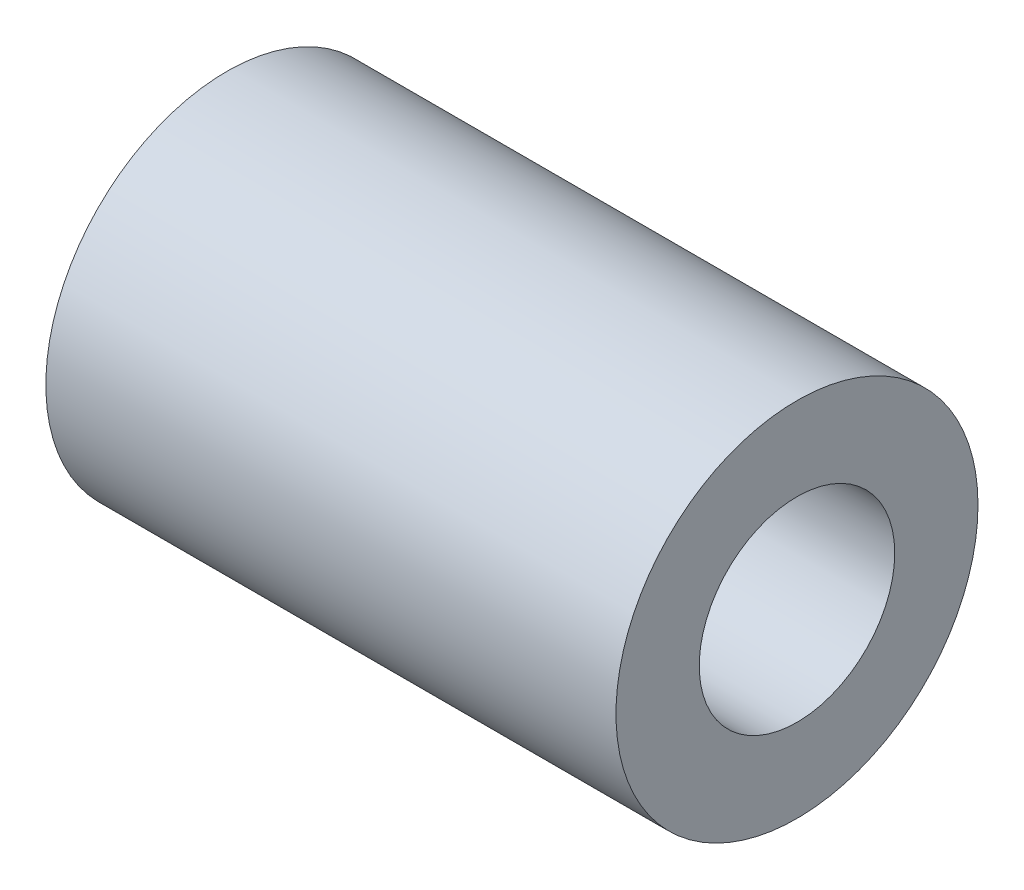
ISO-10303-21;
HEADER;
FILE_DESCRIPTION(('STEP AP214'),'2;1');
FILE_NAME('part.step','',(''),(''),'','','');
FILE_SCHEMA(('AUTOMOTIVE_DESIGN { 1 0 10303 214 1 1 1 1 }'));
ENDSEC;
DATA;
#1=APPLICATION_CONTEXT('core data for automotive mechanical design processes');
#2=APPLICATION_PROTOCOL_DEFINITION('international standard','automotive_design',2000,#1);
#3=PRODUCT_CONTEXT('',#1,'mechanical');
#4=PRODUCT('Part','Part','',(#3));
#5=PRODUCT_RELATED_PRODUCT_CATEGORY('part','',(#4));
#6=PRODUCT_DEFINITION_FORMATION('','',#4);
#7=PRODUCT_DEFINITION_CONTEXT('part definition',#1,'design');
#8=PRODUCT_DEFINITION('design','',#6,#7);
#9=PRODUCT_DEFINITION_SHAPE('','',#8);
#10=(LENGTH_UNIT() NAMED_UNIT(*) SI_UNIT(.MILLI.,.METRE.));
#11=(NAMED_UNIT(*) PLANE_ANGLE_UNIT() SI_UNIT($,.RADIAN.));
#12=(NAMED_UNIT(*) SI_UNIT($,.STERADIAN.) SOLID_ANGLE_UNIT());
#13=UNCERTAINTY_MEASURE_WITH_UNIT(LENGTH_MEASURE(1.E-05),#10,'distance_accuracy_value','');
#14=(GEOMETRIC_REPRESENTATION_CONTEXT(3) GLOBAL_UNCERTAINTY_ASSIGNED_CONTEXT((#13)) GLOBAL_UNIT_ASSIGNED_CONTEXT((#10,
#11,#12)) REPRESENTATION_CONTEXT('',''));
#15=CARTESIAN_POINT('',(0.,0.,0.));
#16=DIRECTION('',(0.,0.,1.));
#17=DIRECTION('',(1.,0.,0.));
#18=AXIS2_PLACEMENT_3D('',#15,#16,#17);
#19=CARTESIAN_POINT('',(-20.,0.,0.));
#20=DIRECTION('',(1.,0.,0.));
#21=DIRECTION('',(0.,0.,-1.));
#22=AXIS2_PLACEMENT_3D('',#19,#20,#21);
#23=CYLINDRICAL_SURFACE('',#22,6.35);
#24=CARTESIAN_POINT('',(-20.,0.,0.));
#25=DIRECTION('',(1.,0.,0.));
#26=DIRECTION('',(0.,0.,-1.));
#27=AXIS2_PLACEMENT_3D('',#24,#25,#26);
#28=CIRCLE('',#27,6.35);
#29=CARTESIAN_POINT('',(-20.,0.,-6.35));
#30=VERTEX_POINT('',#29);
#31=EDGE_CURVE('E10',#30,#30,#28,.T.);
#32=ORIENTED_EDGE('',*,*,#31,.T.);
#33=EDGE_LOOP('',(#32));
#34=FACE_BOUND('',#33,.T.);
#35=CARTESIAN_POINT('',(0.,0.,0.));
#36=DIRECTION('',(1.,0.,0.));
#37=DIRECTION('',(0.,0.,-1.));
#38=AXIS2_PLACEMENT_3D('',#35,#36,#37);
#39=CIRCLE('',#38,6.35);
#40=CARTESIAN_POINT('',(0.,0.,-6.35));
#41=VERTEX_POINT('',#40);
#42=EDGE_CURVE('E34',#41,#41,#39,.T.);
#43=ORIENTED_EDGE('',*,*,#42,.F.);
#44=EDGE_LOOP('',(#43));
#45=FACE_BOUND('',#44,.T.);
#46=ADVANCED_FACE('F31',(#34,#45),#23,.T.);
#47=CARTESIAN_POINT('',(-20.,0.,0.));
#48=DIRECTION('',(1.,0.,0.));
#49=DIRECTION('',(0.,0.,-1.));
#50=AXIS2_PLACEMENT_3D('',#47,#48,#49);
#51=PLANE('',#50);
#52=CARTESIAN_POINT('',(-20.,0.,0.));
#53=DIRECTION('',(1.,0.,0.));
#54=DIRECTION('',(0.,0.,-1.));
#55=AXIS2_PLACEMENT_3D('',#52,#53,#54);
#56=CIRCLE('',#55,3.429);
#57=CARTESIAN_POINT('',(-20.,0.,-3.429));
#58=VERTEX_POINT('',#57);
#59=EDGE_CURVE('E41',#58,#58,#56,.T.);
#60=ORIENTED_EDGE('',*,*,#59,.T.);
#61=EDGE_LOOP('',(#60));
#62=FACE_BOUND('',#61,.T.);
#63=ORIENTED_EDGE('',*,*,#31,.F.);
#64=EDGE_LOOP('',(#63));
#65=FACE_BOUND('',#64,.T.);
#66=ADVANCED_FACE('F49',(#62,#65),#51,.F.);
#67=CARTESIAN_POINT('',(0.,0.,0.));
#68=DIRECTION('',(1.,0.,0.));
#69=DIRECTION('',(0.,0.,-1.));
#70=AXIS2_PLACEMENT_3D('',#67,#68,#69);
#71=PLANE('',#70);
#72=CARTESIAN_POINT('',(0.,0.,0.));
#73=DIRECTION('',(1.,0.,0.));
#74=DIRECTION('',(0.,0.,-1.));
#75=AXIS2_PLACEMENT_3D('',#72,#73,#74);
#76=CIRCLE('',#75,3.429);
#77=CARTESIAN_POINT('',(0.,0.,-3.429));
#78=VERTEX_POINT('',#77);
#79=EDGE_CURVE('E43',#78,#78,#76,.T.);
#80=ORIENTED_EDGE('',*,*,#79,.F.);
#81=EDGE_LOOP('',(#80));
#82=FACE_BOUND('',#81,.T.);
#83=ORIENTED_EDGE('',*,*,#42,.T.);
#84=EDGE_LOOP('',(#83));
#85=FACE_BOUND('',#84,.T.);
#86=ADVANCED_FACE('F55',(#82,#85),#71,.T.);
#87=CARTESIAN_POINT('',(-20.,0.,0.));
#88=DIRECTION('',(1.,0.,0.));
#89=DIRECTION('',(0.,0.,-1.));
#90=AXIS2_PLACEMENT_3D('',#87,#88,#89);
#91=CYLINDRICAL_SURFACE('',#90,3.429);
#92=ORIENTED_EDGE('',*,*,#59,.F.);
#93=EDGE_LOOP('',(#92));
#94=FACE_BOUND('',#93,.T.);
#95=ORIENTED_EDGE('',*,*,#79,.T.);
#96=EDGE_LOOP('',(#95));
#97=FACE_BOUND('',#96,.T.);
#98=ADVANCED_FACE('F52',(#94,#97),#91,.F.);
#99=CLOSED_SHELL('',(#46,#66,#86,#98));
#100=MANIFOLD_SOLID_BREP('B2',#99);
#101=ADVANCED_BREP_SHAPE_REPRESENTATION('',(#18,#100),#14);
#102=SHAPE_DEFINITION_REPRESENTATION(#9,#101);
ENDSEC;
END-ISO-10303-21;
